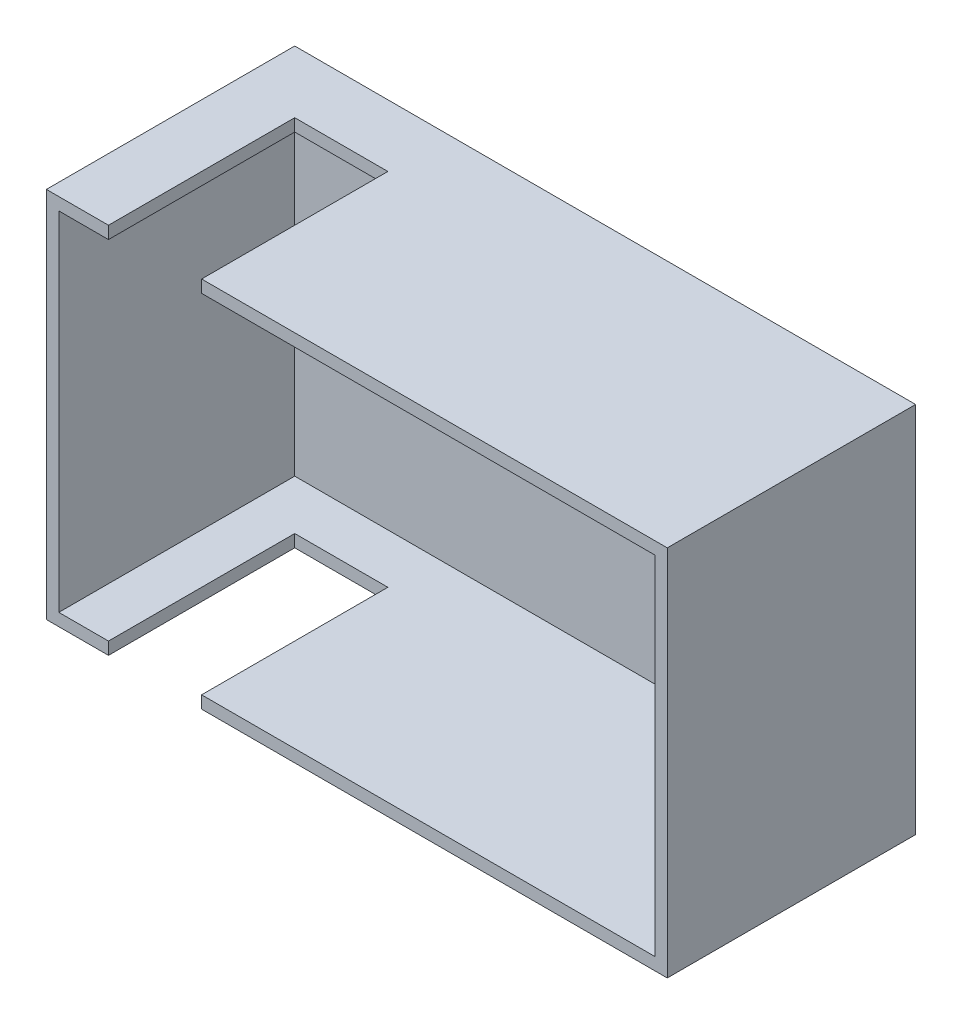
ISO-10303-21;
HEADER;
FILE_DESCRIPTION(('STEP AP214'),'2;1');
FILE_NAME('part.step','',(''),(''),'','','');
FILE_SCHEMA(('AUTOMOTIVE_DESIGN { 1 0 10303 214 1 1 1 1 }'));
ENDSEC;
DATA;
#1=APPLICATION_CONTEXT('core data for automotive mechanical design processes');
#2=APPLICATION_PROTOCOL_DEFINITION('international standard','automotive_design',2000,#1);
#3=PRODUCT_CONTEXT('',#1,'mechanical');
#4=PRODUCT('Part','Part','',(#3));
#5=PRODUCT_RELATED_PRODUCT_CATEGORY('part','',(#4));
#6=PRODUCT_DEFINITION_FORMATION('','',#4);
#7=PRODUCT_DEFINITION_CONTEXT('part definition',#1,'design');
#8=PRODUCT_DEFINITION('design','',#6,#7);
#9=PRODUCT_DEFINITION_SHAPE('','',#8);
#10=(LENGTH_UNIT() NAMED_UNIT(*) SI_UNIT(.MILLI.,.METRE.));
#11=(NAMED_UNIT(*) PLANE_ANGLE_UNIT() SI_UNIT($,.RADIAN.));
#12=(NAMED_UNIT(*) SI_UNIT($,.STERADIAN.) SOLID_ANGLE_UNIT());
#13=UNCERTAINTY_MEASURE_WITH_UNIT(LENGTH_MEASURE(1.E-05),#10,'distance_accuracy_value','');
#14=(GEOMETRIC_REPRESENTATION_CONTEXT(3) GLOBAL_UNCERTAINTY_ASSIGNED_CONTEXT((#13)) GLOBAL_UNIT_ASSIGNED_CONTEXT((#10,
#11,#12)) REPRESENTATION_CONTEXT('',''));
#15=CARTESIAN_POINT('',(0.,0.,0.));
#16=DIRECTION('',(0.,0.,1.));
#17=DIRECTION('',(1.,0.,0.));
#18=AXIS2_PLACEMENT_3D('',#15,#16,#17);
#19=CARTESIAN_POINT('',(0.,0.,40.));
#20=DIRECTION('',(0.,0.,1.));
#21=DIRECTION('',(1.,0.,0.));
#22=AXIS2_PLACEMENT_3D('',#19,#20,#21);
#23=PLANE('',#22);
#24=DIRECTION('',(0.,-1.,0.));
#25=VECTOR('',#24,1.);
#26=CARTESIAN_POINT('',(-40.,30.,40.));
#27=LINE('',#26,#25);
#28=CARTESIAN_POINT('',(-40.,30.,40.));
#29=VERTEX_POINT('',#28);
#30=CARTESIAN_POINT('',(-40.,28.,40.));
#31=VERTEX_POINT('',#30);
#32=EDGE_CURVE('E176',#29,#31,#27,.T.);
#33=ORIENTED_EDGE('',*,*,#32,.F.);
#34=DIRECTION('',(-1.,0.,0.));
#35=VECTOR('',#34,1.);
#36=CARTESIAN_POINT('',(-50.,30.,40.));
#37=LINE('',#36,#35);
#38=CARTESIAN_POINT('',(-50.,30.,40.));
#39=VERTEX_POINT('',#38);
#40=EDGE_CURVE('E165',#29,#39,#37,.T.);
#41=ORIENTED_EDGE('',*,*,#40,.T.);
#42=DIRECTION('',(0.,-1.,0.));
#43=VECTOR('',#42,1.);
#44=CARTESIAN_POINT('',(-50.,30.,40.));
#45=LINE('',#44,#43);
#46=CARTESIAN_POINT('',(-50.,-30.,40.));
#47=VERTEX_POINT('',#46);
#48=EDGE_CURVE('E231',#39,#47,#45,.T.);
#49=ORIENTED_EDGE('',*,*,#48,.T.);
#50=DIRECTION('',(1.,0.,0.));
#51=VECTOR('',#50,1.);
#52=CARTESIAN_POINT('',(-50.,-30.,40.));
#53=LINE('',#52,#51);
#54=CARTESIAN_POINT('',(-40.,-30.,40.));
#55=VERTEX_POINT('',#54);
#56=EDGE_CURVE('E234',#47,#55,#53,.T.);
#57=ORIENTED_EDGE('',*,*,#56,.T.);
#58=CARTESIAN_POINT('',(-40.,-28.,40.));
#59=VERTEX_POINT('',#58);
#60=EDGE_CURVE('E179',#59,#55,#27,.T.);
#61=ORIENTED_EDGE('',*,*,#60,.F.);
#62=DIRECTION('',(1.,0.,0.));
#63=VECTOR('',#62,1.);
#64=CARTESIAN_POINT('',(-50.,-28.,40.));
#65=LINE('',#64,#63);
#66=CARTESIAN_POINT('',(-48.,-28.,40.));
#67=VERTEX_POINT('',#66);
#68=EDGE_CURVE('E202',#67,#59,#65,.T.);
#69=ORIENTED_EDGE('',*,*,#68,.F.);
#70=DIRECTION('',(0.,-1.,0.));
#71=VECTOR('',#70,1.);
#72=CARTESIAN_POINT('',(-48.,30.,40.));
#73=LINE('',#72,#71);
#74=CARTESIAN_POINT('',(-48.,28.,40.));
#75=VERTEX_POINT('',#74);
#76=EDGE_CURVE('E218',#75,#67,#73,.T.);
#77=ORIENTED_EDGE('',*,*,#76,.F.);
#78=DIRECTION('',(-1.,0.,0.));
#79=VECTOR('',#78,1.);
#80=CARTESIAN_POINT('',(-50.,28.,40.));
#81=LINE('',#80,#79);
#82=EDGE_CURVE('E214',#31,#75,#81,.T.);
#83=ORIENTED_EDGE('',*,*,#82,.F.);
#84=EDGE_LOOP('',(#33,#41,#49,#57,#61,#69,#77,#83));
#85=FACE_BOUND('',#84,.T.);
#86=ADVANCED_FACE('F33',(#85),#23,.T.);
#87=CARTESIAN_POINT('',(50.,30.,40.));
#88=DIRECTION('',(-1.,0.,0.));
#89=DIRECTION('',(0.,-1.,0.));
#90=AXIS2_PLACEMENT_3D('',#87,#88,#89);
#91=PLANE('',#90);
#92=DIRECTION('',(0.,1.,0.));
#93=VECTOR('',#92,1.);
#94=CARTESIAN_POINT('',(50.,30.,0.));
#95=LINE('',#94,#93);
#96=CARTESIAN_POINT('',(50.,-30.,0.));
#97=VERTEX_POINT('',#96);
#98=CARTESIAN_POINT('',(50.,30.,0.));
#99=VERTEX_POINT('',#98);
#100=EDGE_CURVE('E196',#97,#99,#95,.T.);
#101=ORIENTED_EDGE('',*,*,#100,.T.);
#102=DIRECTION('',(0.,0.,-1.));
#103=VECTOR('',#102,1.);
#104=CARTESIAN_POINT('',(50.,30.,40.));
#105=LINE('',#104,#103);
#106=CARTESIAN_POINT('',(50.,30.,40.));
#107=VERTEX_POINT('',#106);
#108=EDGE_CURVE('E253',#107,#99,#105,.T.);
#109=ORIENTED_EDGE('',*,*,#108,.F.);
#110=DIRECTION('',(0.,1.,0.));
#111=VECTOR('',#110,1.);
#112=CARTESIAN_POINT('',(50.,30.,40.));
#113=LINE('',#112,#111);
#114=CARTESIAN_POINT('',(50.,-30.,40.));
#115=VERTEX_POINT('',#114);
#116=EDGE_CURVE('E224',#115,#107,#113,.T.);
#117=ORIENTED_EDGE('',*,*,#116,.F.);
#118=DIRECTION('',(0.,0.,-1.));
#119=VECTOR('',#118,1.);
#120=CARTESIAN_POINT('',(50.,-30.,40.));
#121=LINE('',#120,#119);
#122=EDGE_CURVE('E237',#115,#97,#121,.T.);
#123=ORIENTED_EDGE('',*,*,#122,.T.);
#124=EDGE_LOOP('',(#101,#109,#117,#123));
#125=FACE_BOUND('',#124,.T.);
#126=ADVANCED_FACE('F35',(#125),#91,.F.);
#127=CARTESIAN_POINT('',(-50.,30.,40.));
#128=DIRECTION('',(0.,-1.,0.));
#129=DIRECTION('',(0.,0.,-1.));
#130=AXIS2_PLACEMENT_3D('',#127,#128,#129);
#131=PLANE('',#130);
#132=ORIENTED_EDGE('',*,*,#40,.F.);
#133=DIRECTION('',(0.,0.,-1.));
#134=VECTOR('',#133,1.);
#135=CARTESIAN_POINT('',(-40.,30.,40.));
#136=LINE('',#135,#134);
#137=CARTESIAN_POINT('',(-40.,30.,10.));
#138=VERTEX_POINT('',#137);
#139=EDGE_CURVE('E145',#29,#138,#136,.T.);
#140=ORIENTED_EDGE('',*,*,#139,.T.);
#141=DIRECTION('',(1.,0.,0.));
#142=VECTOR('',#141,1.);
#143=CARTESIAN_POINT('',(-40.,30.,10.));
#144=LINE('',#143,#142);
#145=CARTESIAN_POINT('',(-25.,30.,10.));
#146=VERTEX_POINT('',#145);
#147=EDGE_CURVE('E153',#138,#146,#144,.T.);
#148=ORIENTED_EDGE('',*,*,#147,.T.);
#149=DIRECTION('',(0.,0.,1.));
#150=VECTOR('',#149,1.);
#151=CARTESIAN_POINT('',(-25.,30.,40.));
#152=LINE('',#151,#150);
#153=CARTESIAN_POINT('',(-25.,30.,40.));
#154=VERTEX_POINT('',#153);
#155=EDGE_CURVE('E160',#146,#154,#152,.T.);
#156=ORIENTED_EDGE('',*,*,#155,.T.);
#157=EDGE_CURVE('E228',#107,#154,#37,.T.);
#158=ORIENTED_EDGE('',*,*,#157,.F.);
#159=ORIENTED_EDGE('',*,*,#108,.T.);
#160=DIRECTION('',(-1.,0.,0.));
#161=VECTOR('',#160,1.);
#162=CARTESIAN_POINT('',(-50.,30.,0.));
#163=LINE('',#162,#161);
#164=CARTESIAN_POINT('',(-50.,30.,0.));
#165=VERTEX_POINT('',#164);
#166=EDGE_CURVE('E240',#99,#165,#163,.T.);
#167=ORIENTED_EDGE('',*,*,#166,.T.);
#168=DIRECTION('',(0.,0.,-1.));
#169=VECTOR('',#168,1.);
#170=CARTESIAN_POINT('',(-50.,30.,40.));
#171=LINE('',#170,#169);
#172=EDGE_CURVE('E250',#39,#165,#171,.T.);
#173=ORIENTED_EDGE('',*,*,#172,.F.);
#174=EDGE_LOOP('',(#132,#140,#148,#156,#158,#159,#167,#173));
#175=FACE_BOUND('',#174,.T.);
#176=ADVANCED_FACE('F163',(#175),#131,.F.);
#177=CARTESIAN_POINT('',(-50.,30.,40.));
#178=DIRECTION('',(1.,0.,0.));
#179=DIRECTION('',(0.,1.,0.));
#180=AXIS2_PLACEMENT_3D('',#177,#178,#179);
#181=PLANE('',#180);
#182=DIRECTION('',(0.,-1.,0.));
#183=VECTOR('',#182,1.);
#184=CARTESIAN_POINT('',(-50.,30.,0.));
#185=LINE('',#184,#183);
#186=CARTESIAN_POINT('',(-50.,-30.,0.));
#187=VERTEX_POINT('',#186);
#188=EDGE_CURVE('E242',#165,#187,#185,.T.);
#189=ORIENTED_EDGE('',*,*,#188,.T.);
#190=DIRECTION('',(0.,0.,-1.));
#191=VECTOR('',#190,1.);
#192=CARTESIAN_POINT('',(-50.,-30.,40.));
#193=LINE('',#192,#191);
#194=EDGE_CURVE('E247',#47,#187,#193,.T.);
#195=ORIENTED_EDGE('',*,*,#194,.F.);
#196=ORIENTED_EDGE('',*,*,#48,.F.);
#197=ORIENTED_EDGE('',*,*,#172,.T.);
#198=EDGE_LOOP('',(#189,#195,#196,#197));
#199=FACE_BOUND('',#198,.T.);
#200=ADVANCED_FACE('F315',(#199),#181,.F.);
#201=CARTESIAN_POINT('',(-50.,-30.,40.));
#202=DIRECTION('',(0.,1.,0.));
#203=DIRECTION('',(0.,0.,1.));
#204=AXIS2_PLACEMENT_3D('',#201,#202,#203);
#205=PLANE('',#204);
#206=DIRECTION('',(1.,0.,0.));
#207=VECTOR('',#206,1.);
#208=CARTESIAN_POINT('',(-40.,-30.,10.));
#209=LINE('',#208,#207);
#210=CARTESIAN_POINT('',(-40.,-30.,10.));
#211=VERTEX_POINT('',#210);
#212=CARTESIAN_POINT('',(-25.,-30.,10.));
#213=VERTEX_POINT('',#212);
#214=EDGE_CURVE('E168',#211,#213,#209,.T.);
#215=ORIENTED_EDGE('',*,*,#214,.F.);
#216=DIRECTION('',(0.,0.,-1.));
#217=VECTOR('',#216,1.);
#218=CARTESIAN_POINT('',(-40.,-30.,40.));
#219=LINE('',#218,#217);
#220=EDGE_CURVE('E172',#55,#211,#219,.T.);
#221=ORIENTED_EDGE('',*,*,#220,.F.);
#222=ORIENTED_EDGE('',*,*,#56,.F.);
#223=ORIENTED_EDGE('',*,*,#194,.T.);
#224=DIRECTION('',(1.,0.,0.));
#225=VECTOR('',#224,1.);
#226=CARTESIAN_POINT('',(-50.,-30.,0.));
#227=LINE('',#226,#225);
#228=EDGE_CURVE('E227',#187,#97,#227,.T.);
#229=ORIENTED_EDGE('',*,*,#228,.T.);
#230=ORIENTED_EDGE('',*,*,#122,.F.);
#231=CARTESIAN_POINT('',(-25.,-30.,40.));
#232=VERTEX_POINT('',#231);
#233=EDGE_CURVE('E233',#232,#115,#53,.T.);
#234=ORIENTED_EDGE('',*,*,#233,.F.);
#235=DIRECTION('',(0.,0.,1.));
#236=VECTOR('',#235,1.);
#237=CARTESIAN_POINT('',(-25.,-30.,40.));
#238=LINE('',#237,#236);
#239=EDGE_CURVE('E166',#213,#232,#238,.T.);
#240=ORIENTED_EDGE('',*,*,#239,.F.);
#241=EDGE_LOOP('',(#215,#221,#222,#223,#229,#230,#234,#240));
#242=FACE_BOUND('',#241,.T.);
#243=ADVANCED_FACE('F276',(#242),#205,.F.);
#244=DIRECTION('',(0.,-1.,0.));
#245=VECTOR('',#244,1.);
#246=CARTESIAN_POINT('',(-25.,30.,40.));
#247=LINE('',#246,#245);
#248=CARTESIAN_POINT('',(-25.,-28.,40.));
#249=VERTEX_POINT('',#248);
#250=EDGE_CURVE('E183',#249,#232,#247,.T.);
#251=ORIENTED_EDGE('',*,*,#250,.T.);
#252=ORIENTED_EDGE('',*,*,#233,.T.);
#253=ORIENTED_EDGE('',*,*,#116,.T.);
#254=ORIENTED_EDGE('',*,*,#157,.T.);
#255=CARTESIAN_POINT('',(-25.,28.,40.));
#256=VERTEX_POINT('',#255);
#257=EDGE_CURVE('E180',#154,#256,#247,.T.);
#258=ORIENTED_EDGE('',*,*,#257,.T.);
#259=CARTESIAN_POINT('',(48.,28.,40.));
#260=VERTEX_POINT('',#259);
#261=EDGE_CURVE('E215',#260,#256,#81,.T.);
#262=ORIENTED_EDGE('',*,*,#261,.F.);
#263=DIRECTION('',(0.,1.,0.));
#264=VECTOR('',#263,1.);
#265=CARTESIAN_POINT('',(48.,30.,40.));
#266=LINE('',#265,#264);
#267=CARTESIAN_POINT('',(48.,-28.,40.));
#268=VERTEX_POINT('',#267);
#269=EDGE_CURVE('E212',#268,#260,#266,.T.);
#270=ORIENTED_EDGE('',*,*,#269,.F.);
#271=EDGE_CURVE('E221',#249,#268,#65,.T.);
#272=ORIENTED_EDGE('',*,*,#271,.F.);
#273=EDGE_LOOP('',(#251,#252,#253,#254,#258,#262,#270,#272));
#274=FACE_BOUND('',#273,.T.);
#275=ADVANCED_FACE('F280',(#274),#23,.T.);
#276=CARTESIAN_POINT('',(0.,0.,0.));
#277=DIRECTION('',(0.,0.,1.));
#278=DIRECTION('',(1.,0.,0.));
#279=AXIS2_PLACEMENT_3D('',#276,#277,#278);
#280=PLANE('',#279);
#281=ORIENTED_EDGE('',*,*,#100,.F.);
#282=ORIENTED_EDGE('',*,*,#228,.F.);
#283=ORIENTED_EDGE('',*,*,#188,.F.);
#284=ORIENTED_EDGE('',*,*,#166,.F.);
#285=EDGE_LOOP('',(#281,#282,#283,#284));
#286=FACE_BOUND('',#285,.T.);
#287=ADVANCED_FACE('F306',(#286),#280,.F.);
#288=CARTESIAN_POINT('',(48.,30.,40.));
#289=DIRECTION('',(-1.,0.,0.));
#290=DIRECTION('',(0.,-1.,0.));
#291=AXIS2_PLACEMENT_3D('',#288,#289,#290);
#292=PLANE('',#291);
#293=DIRECTION('',(0.,1.,0.));
#294=VECTOR('',#293,1.);
#295=CARTESIAN_POINT('',(48.,30.,2.));
#296=LINE('',#295,#294);
#297=CARTESIAN_POINT('',(48.,-28.,2.));
#298=VERTEX_POINT('',#297);
#299=CARTESIAN_POINT('',(48.,28.,2.));
#300=VERTEX_POINT('',#299);
#301=EDGE_CURVE('E189',#298,#300,#296,.T.);
#302=ORIENTED_EDGE('',*,*,#301,.F.);
#303=DIRECTION('',(0.,0.,-1.));
#304=VECTOR('',#303,1.);
#305=CARTESIAN_POINT('',(48.,-28.,40.));
#306=LINE('',#305,#304);
#307=EDGE_CURVE('E198',#268,#298,#306,.T.);
#308=ORIENTED_EDGE('',*,*,#307,.F.);
#309=ORIENTED_EDGE('',*,*,#269,.T.);
#310=DIRECTION('',(0.,0.,-1.));
#311=VECTOR('',#310,1.);
#312=CARTESIAN_POINT('',(48.,28.,40.));
#313=LINE('',#312,#311);
#314=EDGE_CURVE('E193',#260,#300,#313,.T.);
#315=ORIENTED_EDGE('',*,*,#314,.T.);
#316=EDGE_LOOP('',(#302,#308,#309,#315));
#317=FACE_BOUND('',#316,.T.);
#318=ADVANCED_FACE('F287',(#317),#292,.T.);
#319=CARTESIAN_POINT('',(-50.,28.,40.));
#320=DIRECTION('',(0.,-1.,0.));
#321=DIRECTION('',(0.,0.,-1.));
#322=AXIS2_PLACEMENT_3D('',#319,#320,#321);
#323=PLANE('',#322);
#324=DIRECTION('',(0.,0.,-1.));
#325=VECTOR('',#324,1.);
#326=CARTESIAN_POINT('',(-40.,28.,40.));
#327=LINE('',#326,#325);
#328=CARTESIAN_POINT('',(-40.,28.,10.));
#329=VERTEX_POINT('',#328);
#330=EDGE_CURVE('E148',#31,#329,#327,.T.);
#331=ORIENTED_EDGE('',*,*,#330,.F.);
#332=ORIENTED_EDGE('',*,*,#82,.T.);
#333=DIRECTION('',(0.,0.,-1.));
#334=VECTOR('',#333,1.);
#335=CARTESIAN_POINT('',(-48.,28.,40.));
#336=LINE('',#335,#334);
#337=CARTESIAN_POINT('',(-48.,28.,2.));
#338=VERTEX_POINT('',#337);
#339=EDGE_CURVE('E197',#75,#338,#336,.T.);
#340=ORIENTED_EDGE('',*,*,#339,.T.);
#341=DIRECTION('',(-1.,0.,0.));
#342=VECTOR('',#341,1.);
#343=CARTESIAN_POINT('',(-50.,28.,2.));
#344=LINE('',#343,#342);
#345=EDGE_CURVE('E192',#300,#338,#344,.T.);
#346=ORIENTED_EDGE('',*,*,#345,.F.);
#347=ORIENTED_EDGE('',*,*,#314,.F.);
#348=ORIENTED_EDGE('',*,*,#261,.T.);
#349=DIRECTION('',(0.,0.,1.));
#350=VECTOR('',#349,1.);
#351=CARTESIAN_POINT('',(-25.,28.,40.));
#352=LINE('',#351,#350);
#353=CARTESIAN_POINT('',(-25.,28.,10.));
#354=VERTEX_POINT('',#353);
#355=EDGE_CURVE('E186',#354,#256,#352,.T.);
#356=ORIENTED_EDGE('',*,*,#355,.F.);
#357=DIRECTION('',(1.,0.,0.));
#358=VECTOR('',#357,1.);
#359=CARTESIAN_POINT('',(-50.,28.,10.));
#360=LINE('',#359,#358);
#361=EDGE_CURVE('E178',#329,#354,#360,.T.);
#362=ORIENTED_EDGE('',*,*,#361,.F.);
#363=EDGE_LOOP('',(#331,#332,#340,#346,#347,#348,#356,#362));
#364=FACE_BOUND('',#363,.T.);
#365=ADVANCED_FACE('F314',(#364),#323,.T.);
#366=CARTESIAN_POINT('',(-48.,30.,40.));
#367=DIRECTION('',(1.,0.,0.));
#368=DIRECTION('',(0.,1.,0.));
#369=AXIS2_PLACEMENT_3D('',#366,#367,#368);
#370=PLANE('',#369);
#371=DIRECTION('',(0.,-1.,0.));
#372=VECTOR('',#371,1.);
#373=CARTESIAN_POINT('',(-48.,30.,2.));
#374=LINE('',#373,#372);
#375=CARTESIAN_POINT('',(-48.,-28.,2.));
#376=VERTEX_POINT('',#375);
#377=EDGE_CURVE('E204',#338,#376,#374,.T.);
#378=ORIENTED_EDGE('',*,*,#377,.F.);
#379=ORIENTED_EDGE('',*,*,#339,.F.);
#380=ORIENTED_EDGE('',*,*,#76,.T.);
#381=DIRECTION('',(0.,0.,-1.));
#382=VECTOR('',#381,1.);
#383=CARTESIAN_POINT('',(-48.,-28.,40.));
#384=LINE('',#383,#382);
#385=EDGE_CURVE('E201',#67,#376,#384,.T.);
#386=ORIENTED_EDGE('',*,*,#385,.T.);
#387=EDGE_LOOP('',(#378,#379,#380,#386));
#388=FACE_BOUND('',#387,.T.);
#389=ADVANCED_FACE('F296',(#388),#370,.T.);
#390=CARTESIAN_POINT('',(-50.,-28.,40.));
#391=DIRECTION('',(0.,1.,0.));
#392=DIRECTION('',(0.,0.,1.));
#393=AXIS2_PLACEMENT_3D('',#390,#391,#392);
#394=PLANE('',#393);
#395=DIRECTION('',(0.,0.,1.));
#396=VECTOR('',#395,1.);
#397=CARTESIAN_POINT('',(-40.,-28.,40.));
#398=LINE('',#397,#396);
#399=CARTESIAN_POINT('',(-40.,-28.,10.));
#400=VERTEX_POINT('',#399);
#401=EDGE_CURVE('E11',#400,#59,#398,.T.);
#402=ORIENTED_EDGE('',*,*,#401,.F.);
#403=DIRECTION('',(-1.,0.,0.));
#404=VECTOR('',#403,1.);
#405=CARTESIAN_POINT('',(-50.,-28.,10.));
#406=LINE('',#405,#404);
#407=CARTESIAN_POINT('',(-25.,-28.,10.));
#408=VERTEX_POINT('',#407);
#409=EDGE_CURVE('E256',#408,#400,#406,.T.);
#410=ORIENTED_EDGE('',*,*,#409,.F.);
#411=DIRECTION('',(0.,0.,-1.));
#412=VECTOR('',#411,1.);
#413=CARTESIAN_POINT('',(-25.,-28.,40.));
#414=LINE('',#413,#412);
#415=EDGE_CURVE('E41',#249,#408,#414,.T.);
#416=ORIENTED_EDGE('',*,*,#415,.F.);
#417=ORIENTED_EDGE('',*,*,#271,.T.);
#418=ORIENTED_EDGE('',*,*,#307,.T.);
#419=DIRECTION('',(1.,0.,0.));
#420=VECTOR('',#419,1.);
#421=CARTESIAN_POINT('',(-50.,-28.,2.));
#422=LINE('',#421,#420);
#423=EDGE_CURVE('E208',#376,#298,#422,.T.);
#424=ORIENTED_EDGE('',*,*,#423,.F.);
#425=ORIENTED_EDGE('',*,*,#385,.F.);
#426=ORIENTED_EDGE('',*,*,#68,.T.);
#427=EDGE_LOOP('',(#402,#410,#416,#417,#418,#424,#425,#426));
#428=FACE_BOUND('',#427,.T.);
#429=ADVANCED_FACE('F265',(#428),#394,.T.);
#430=CARTESIAN_POINT('',(0.,0.,2.));
#431=DIRECTION('',(0.,0.,1.));
#432=DIRECTION('',(1.,0.,0.));
#433=AXIS2_PLACEMENT_3D('',#430,#431,#432);
#434=PLANE('',#433);
#435=ORIENTED_EDGE('',*,*,#301,.T.);
#436=ORIENTED_EDGE('',*,*,#345,.T.);
#437=ORIENTED_EDGE('',*,*,#377,.T.);
#438=ORIENTED_EDGE('',*,*,#423,.T.);
#439=EDGE_LOOP('',(#435,#436,#437,#438));
#440=FACE_BOUND('',#439,.T.);
#441=ADVANCED_FACE('F290',(#440),#434,.T.);
#442=CARTESIAN_POINT('',(-40.,30.,10.));
#443=DIRECTION('',(0.,0.,-1.));
#444=DIRECTION('',(-1.,0.,0.));
#445=AXIS2_PLACEMENT_3D('',#442,#443,#444);
#446=PLANE('',#445);
#447=ORIENTED_EDGE('',*,*,#409,.T.);
#448=DIRECTION('',(0.,-1.,0.));
#449=VECTOR('',#448,1.);
#450=CARTESIAN_POINT('',(-40.,30.,10.));
#451=LINE('',#450,#449);
#452=EDGE_CURVE('E150',#400,#211,#451,.T.);
#453=ORIENTED_EDGE('',*,*,#452,.T.);
#454=ORIENTED_EDGE('',*,*,#214,.T.);
#455=DIRECTION('',(0.,-1.,0.));
#456=VECTOR('',#455,1.);
#457=CARTESIAN_POINT('',(-25.,30.,10.));
#458=LINE('',#457,#456);
#459=EDGE_CURVE('E56',#408,#213,#458,.T.);
#460=ORIENTED_EDGE('',*,*,#459,.F.);
#461=EDGE_LOOP('',(#447,#453,#454,#460));
#462=FACE_BOUND('',#461,.T.);
#463=ADVANCED_FACE('F267',(#462),#446,.F.);
#464=CARTESIAN_POINT('',(-25.,30.,40.));
#465=DIRECTION('',(1.,0.,0.));
#466=DIRECTION('',(0.,0.,-1.));
#467=AXIS2_PLACEMENT_3D('',#464,#465,#466);
#468=PLANE('',#467);
#469=ORIENTED_EDGE('',*,*,#415,.T.);
#470=ORIENTED_EDGE('',*,*,#459,.T.);
#471=ORIENTED_EDGE('',*,*,#239,.T.);
#472=ORIENTED_EDGE('',*,*,#250,.F.);
#473=EDGE_LOOP('',(#469,#470,#471,#472));
#474=FACE_BOUND('',#473,.T.);
#475=ADVANCED_FACE('F260',(#474),#468,.F.);
#476=CARTESIAN_POINT('',(-40.,30.,40.));
#477=DIRECTION('',(-1.,0.,0.));
#478=DIRECTION('',(0.,0.,1.));
#479=AXIS2_PLACEMENT_3D('',#476,#477,#478);
#480=PLANE('',#479);
#481=ORIENTED_EDGE('',*,*,#401,.T.);
#482=ORIENTED_EDGE('',*,*,#60,.T.);
#483=ORIENTED_EDGE('',*,*,#220,.T.);
#484=ORIENTED_EDGE('',*,*,#452,.F.);
#485=EDGE_LOOP('',(#481,#482,#483,#484));
#486=FACE_BOUND('',#485,.T.);
#487=ADVANCED_FACE('F269',(#486),#480,.F.);
#488=ORIENTED_EDGE('',*,*,#330,.T.);
#489=EDGE_CURVE('E48',#138,#329,#451,.T.);
#490=ORIENTED_EDGE('',*,*,#489,.F.);
#491=ORIENTED_EDGE('',*,*,#139,.F.);
#492=ORIENTED_EDGE('',*,*,#32,.T.);
#493=EDGE_LOOP('',(#488,#490,#491,#492));
#494=FACE_BOUND('',#493,.T.);
#495=ADVANCED_FACE('F143',(#494),#480,.F.);
#496=ORIENTED_EDGE('',*,*,#355,.T.);
#497=ORIENTED_EDGE('',*,*,#257,.F.);
#498=ORIENTED_EDGE('',*,*,#155,.F.);
#499=EDGE_CURVE('E156',#146,#354,#458,.T.);
#500=ORIENTED_EDGE('',*,*,#499,.T.);
#501=EDGE_LOOP('',(#496,#497,#498,#500));
#502=FACE_BOUND('',#501,.T.);
#503=ADVANCED_FACE('F311',(#502),#468,.F.);
#504=ORIENTED_EDGE('',*,*,#361,.T.);
#505=ORIENTED_EDGE('',*,*,#499,.F.);
#506=ORIENTED_EDGE('',*,*,#147,.F.);
#507=ORIENTED_EDGE('',*,*,#489,.T.);
#508=EDGE_LOOP('',(#504,#505,#506,#507));
#509=FACE_BOUND('',#508,.T.);
#510=ADVANCED_FACE('F154',(#509),#446,.F.);
#511=CLOSED_SHELL('',(#86,#126,#176,#200,#243,#275,#287,#318,#365,#389,#429,#441,#463,#475,#487,
#495,#503,#510));
#512=MANIFOLD_SOLID_BREP('B2',#511);
#513=ADVANCED_BREP_SHAPE_REPRESENTATION('',(#18,#512),#14);
#514=SHAPE_DEFINITION_REPRESENTATION(#9,#513);
ENDSEC;
END-ISO-10303-21;
